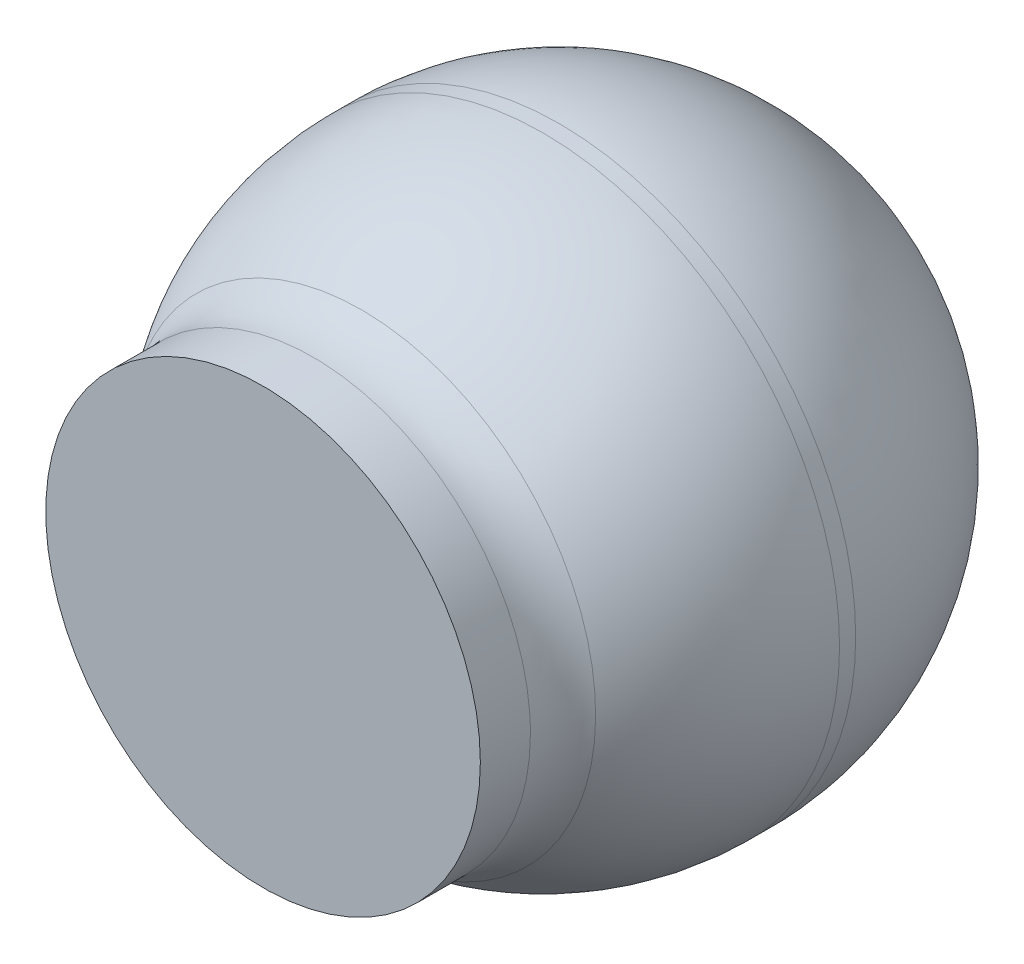
ISO-10303-21;
HEADER;
FILE_DESCRIPTION(('STEP AP214'),'2;1');
FILE_NAME('part.step','',(''),(''),'','','');
FILE_SCHEMA(('AUTOMOTIVE_DESIGN { 1 0 10303 214 1 1 1 1 }'));
ENDSEC;
DATA;
#1=APPLICATION_CONTEXT('core data for automotive mechanical design processes');
#2=APPLICATION_PROTOCOL_DEFINITION('international standard','automotive_design',2000,#1);
#3=PRODUCT_CONTEXT('',#1,'mechanical');
#4=PRODUCT('Part','Part','',(#3));
#5=PRODUCT_RELATED_PRODUCT_CATEGORY('part','',(#4));
#6=PRODUCT_DEFINITION_FORMATION('','',#4);
#7=PRODUCT_DEFINITION_CONTEXT('part definition',#1,'design');
#8=PRODUCT_DEFINITION('design','',#6,#7);
#9=PRODUCT_DEFINITION_SHAPE('','',#8);
#10=(LENGTH_UNIT() NAMED_UNIT(*) SI_UNIT(.MILLI.,.METRE.));
#11=(NAMED_UNIT(*) PLANE_ANGLE_UNIT() SI_UNIT($,.RADIAN.));
#12=(NAMED_UNIT(*) SI_UNIT($,.STERADIAN.) SOLID_ANGLE_UNIT());
#13=UNCERTAINTY_MEASURE_WITH_UNIT(LENGTH_MEASURE(1.E-05),#10,'distance_accuracy_value','');
#14=(GEOMETRIC_REPRESENTATION_CONTEXT(3) GLOBAL_UNCERTAINTY_ASSIGNED_CONTEXT((#13)) GLOBAL_UNIT_ASSIGNED_CONTEXT((#10,
#11,#12)) REPRESENTATION_CONTEXT('',''));
#15=CARTESIAN_POINT('',(0.,0.,0.));
#16=DIRECTION('',(0.,0.,1.));
#17=DIRECTION('',(1.,0.,0.));
#18=AXIS2_PLACEMENT_3D('',#15,#16,#17);
#19=CARTESIAN_POINT('',(0.707080077731,-1.511349291452,10.006534503384));
#20=DIRECTION('',(0.,0.,-1.));
#21=DIRECTION('',(-1.,0.,0.));
#22=AXIS2_PLACEMENT_3D('',#19,#20,#21);
#23=PLANE('',#22);
#24=CARTESIAN_POINT('',(0.707080077731,-1.511349291452,10.006534503384));
#25=DIRECTION('',(0.,0.,1.));
#26=DIRECTION('',(1.,0.,0.));
#27=AXIS2_PLACEMENT_3D('',#24,#25,#26);
#28=CIRCLE('',#27,0.275);
#29=CARTESIAN_POINT('',(0.982080077731,-1.511349291452,10.006534503384));
#30=VERTEX_POINT('',#29);
#31=EDGE_CURVE('E20',#30,#30,#28,.F.);
#32=ORIENTED_EDGE('',*,*,#31,.F.);
#33=EDGE_LOOP('',(#32));
#34=FACE_BOUND('',#33,.T.);
#35=ADVANCED_FACE('F17',(#34),#23,.F.);
#36=CARTESIAN_POINT('',(0.707080077731,-1.511349291452,9.906534503384));
#37=DIRECTION('',(0.,0.,1.));
#38=DIRECTION('',(1.,0.,0.));
#39=AXIS2_PLACEMENT_3D('',#36,#37,#38);
#40=CYLINDRICAL_SURFACE('',#39,0.275);
#41=CARTESIAN_POINT('',(0.707080077731,-1.511349291452,9.943180457728));
#42=DIRECTION('',(0.,0.,-1.));
#43=DIRECTION('',(0.996700902337583,0.0811622527992462,0.));
#44=AXIS2_PLACEMENT_3D('',#41,#42,#43);
#45=CIRCLE('',#44,0.275);
#46=CARTESIAN_POINT('',(0.981172825873835,-1.48902967193221,9.943180457728));
#47=VERTEX_POINT('',#46);
#48=EDGE_CURVE('E65',#47,#47,#45,.F.);
#49=ORIENTED_EDGE('',*,*,#48,.T.);
#50=EDGE_LOOP('',(#49));
#51=FACE_BOUND('',#50,.T.);
#52=ORIENTED_EDGE('',*,*,#31,.T.);
#53=EDGE_LOOP('',(#52));
#54=FACE_BOUND('',#53,.T.);
#55=ADVANCED_FACE('F62',(#51,#54),#40,.T.);
#56=CARTESIAN_POINT('',(0.707080077731,-1.511349291452,9.943180457728));
#57=DIRECTION('',(0.,0.,-1.));
#58=DIRECTION('',(0.996700902337583,0.081162252799246,0.));
#59=AXIS2_PLACEMENT_3D('',#56,#57,#58);
#60=TOROIDAL_SURFACE('',#59,0.375,0.1);
#61=ORIENTED_EDGE('',*,*,#48,.F.);
#62=EDGE_LOOP('',(#61));
#63=FACE_BOUND('',#62,.T.);
#64=CARTESIAN_POINT('',(0.707080077731001,-1.511349291452,9.881744931236));
#65=DIRECTION('',(0.,0.,-1.));
#66=DIRECTION('',(-0.996700902337598,-0.0811622527990614,0.));
#67=AXIS2_PLACEMENT_3D('',#64,#65,#66);
#68=CIRCLE('',#67,0.296097046412665);
#69=CARTESIAN_POINT('',(0.411959884392,-1.535381194786,9.881744931236));
#70=VERTEX_POINT('',#69);
#71=EDGE_CURVE('E39',#70,#70,#68,.T.);
#72=ORIENTED_EDGE('',*,*,#71,.F.);
#73=EDGE_LOOP('',(#72));
#74=FACE_BOUND('',#73,.T.);
#75=ADVANCED_FACE('F57',(#63,#74),#60,.F.);
#76=CARTESIAN_POINT('',(0.333317239355,-1.541785136252,9.651976062157));
#77=CARTESIAN_POINT('',(0.333317239355,-1.541785136252,9.701461392103));
#78=CARTESIAN_POINT('',(0.341473782652,-1.541120941579,9.750947004335));
#79=CARTESIAN_POINT('',(0.357792914651,-1.539792059952,9.798626332798));
#80=CARTESIAN_POINT('',(0.381658609162,-1.537848654938,9.842699544317));
#81=CARTESIAN_POINT('',(0.411959884392,-1.535381194786,9.881744931236));
#82=(BOUNDED_CURVE() B_SPLINE_CURVE(5,(#76,#77,#78,#79,#80,#81),.UNSPECIFIED.,.F.,
.F.) B_SPLINE_CURVE_WITH_KNOTS((6,6),(0.,0.661568582165),
.UNSPECIFIED.) CURVE() GEOMETRIC_REPRESENTATION_ITEM() RATIONAL_B_SPLINE_CURVE((1.,1.,1.,1.,1.,1.)) REPRESENTATION_ITEM(''));
#83=CARTESIAN_POINT('',(0.707080077731,-1.511349291452,9.651976062157));
#84=DIRECTION('',(0.,0.,-1.));
#85=AXIS1_PLACEMENT('',#83,#84);
#86=SURFACE_OF_REVOLUTION('',#82,#85);
#87=CARTESIAN_POINT('',(0.707080077731001,-1.511349291452,9.651976062157));
#88=DIRECTION('',(0.,0.,1.));
#89=DIRECTION('',(1.,0.,0.));
#90=AXIS2_PLACEMENT_3D('',#87,#88,#89);
#91=CIRCLE('',#90,0.375);
#92=CARTESIAN_POINT('',(1.082080077731,-1.511349291452,9.651976062157));
#93=VERTEX_POINT('',#92);
#94=EDGE_CURVE('E36',#93,#93,#91,.F.);
#95=ORIENTED_EDGE('',*,*,#94,.F.);
#96=EDGE_LOOP('',(#95));
#97=FACE_BOUND('',#96,.T.);
#98=ORIENTED_EDGE('',*,*,#71,.T.);
#99=EDGE_LOOP('',(#98));
#100=FACE_BOUND('',#99,.T.);
#101=ADVANCED_FACE('F53',(#97,#100),#86,.F.);
#102=CARTESIAN_POINT('',(0.707080077731,-1.511349291452,9.256534503384));
#103=DIRECTION('',(0.,0.,1.));
#104=DIRECTION('',(1.,0.,0.));
#105=AXIS2_PLACEMENT_3D('',#102,#103,#104);
#106=CYLINDRICAL_SURFACE('',#105,0.375);
#107=CARTESIAN_POINT('',(0.707080077731,-1.511349291452,9.631534503384));
#108=DIRECTION('',(0.,0.,-1.));
#109=DIRECTION('',(0.0811622527992362,-0.996700902337583,0.));
#110=AXIS2_PLACEMENT_3D('',#107,#108,#109);
#111=CIRCLE('',#110,0.375);
#112=CARTESIAN_POINT('',(0.737515922530713,-1.88511212982859,9.631534503384));
#113=VERTEX_POINT('',#112);
#114=CARTESIAN_POINT('',(0.676644232931287,-1.13758645307541,9.631534503384));
#115=VERTEX_POINT('',#114);
#116=EDGE_CURVE('E11',#113,#115,#111,.T.);
#117=ORIENTED_EDGE('',*,*,#116,.F.);
#118=CARTESIAN_POINT('',(0.707080077731,-1.511349291452,9.631534503384));
#119=DIRECTION('',(0.,0.,1.));
#120=DIRECTION('',(0.081162252799236,-0.996700902337583,0.));
#121=AXIS2_PLACEMENT_3D('',#118,#119,#120);
#122=CIRCLE('',#121,0.375);
#123=EDGE_CURVE('E25',#115,#113,#122,.F.);
#124=ORIENTED_EDGE('',*,*,#123,.F.);
#125=EDGE_LOOP('',(#117,#124));
#126=FACE_BOUND('',#125,.T.);
#127=ORIENTED_EDGE('',*,*,#94,.T.);
#128=EDGE_LOOP('',(#127));
#129=FACE_BOUND('',#128,.T.);
#130=ADVANCED_FACE('F34',(#126,#129),#106,.T.);
#131=CARTESIAN_POINT('',(0.707080077731,-1.511349291452,9.631534503384));
#132=DIRECTION('',(0.0811622527992361,-0.996700902337583,0.));
#133=DIRECTION('',(-0.996700902337583,-0.0811622527992361,0.));
#134=AXIS2_PLACEMENT_3D('',#131,#132,#133);
#135=SPHERICAL_SURFACE('',#134,0.375);
#136=ORIENTED_EDGE('',*,*,#123,.T.);
#137=ORIENTED_EDGE('',*,*,#116,.T.);
#138=EDGE_LOOP('',(#136,#137));
#139=FACE_BOUND('',#138,.T.);
#140=ADVANCED_FACE('F32',(#139),#135,.T.);
#141=CLOSED_SHELL('',(#35,#55,#75,#101,#130,#140));
#142=MANIFOLD_SOLID_BREP('B1',#141);
#143=ADVANCED_BREP_SHAPE_REPRESENTATION('',(#18,#142),#14);
#144=SHAPE_DEFINITION_REPRESENTATION(#9,#143);
ENDSEC;
END-ISO-10303-21;
